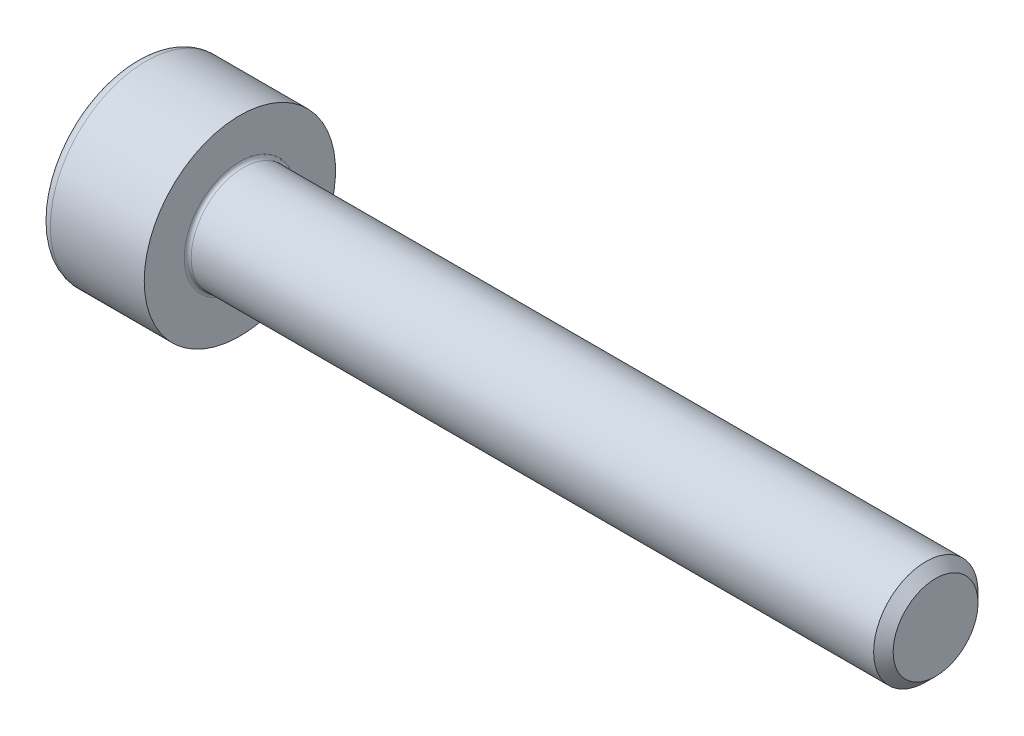
ISO-10303-21;
HEADER;
FILE_DESCRIPTION(('STEP AP214'),'2;1');
FILE_NAME('part.step','',(''),(''),'','','');
FILE_SCHEMA(('AUTOMOTIVE_DESIGN { 1 0 10303 214 1 1 1 1 }'));
ENDSEC;
DATA;
#1=APPLICATION_CONTEXT('core data for automotive mechanical design processes');
#2=APPLICATION_PROTOCOL_DEFINITION('international standard','automotive_design',2000,#1);
#3=PRODUCT_CONTEXT('',#1,'mechanical');
#4=PRODUCT('Part','Part','',(#3));
#5=PRODUCT_RELATED_PRODUCT_CATEGORY('part','',(#4));
#6=PRODUCT_DEFINITION_FORMATION('','',#4);
#7=PRODUCT_DEFINITION_CONTEXT('part definition',#1,'design');
#8=PRODUCT_DEFINITION('design','',#6,#7);
#9=PRODUCT_DEFINITION_SHAPE('','',#8);
#10=(LENGTH_UNIT() NAMED_UNIT(*) SI_UNIT(.MILLI.,.METRE.));
#11=(NAMED_UNIT(*) PLANE_ANGLE_UNIT() SI_UNIT($,.RADIAN.));
#12=(NAMED_UNIT(*) SI_UNIT($,.STERADIAN.) SOLID_ANGLE_UNIT());
#13=UNCERTAINTY_MEASURE_WITH_UNIT(LENGTH_MEASURE(1.E-05),#10,'distance_accuracy_value','');
#14=(GEOMETRIC_REPRESENTATION_CONTEXT(3) GLOBAL_UNCERTAINTY_ASSIGNED_CONTEXT((#13)) GLOBAL_UNIT_ASSIGNED_CONTEXT((#10,
#11,#12)) REPRESENTATION_CONTEXT('',''));
#15=CARTESIAN_POINT('',(0.,0.,0.));
#16=DIRECTION('',(0.,0.,1.));
#17=DIRECTION('',(1.,0.,0.));
#18=AXIS2_PLACEMENT_3D('',#15,#16,#17);
#19=CARTESIAN_POINT('',(0.,0.,0.));
#20=DIRECTION('',(-1.,0.,0.));
#21=DIRECTION('',(0.,0.,1.));
#22=AXIS2_PLACEMENT_3D('',#19,#20,#21);
#23=PLANE('',#22);
#24=DIRECTION('',(0.,-0.499999999999999,0.866025403784439));
#25=VECTOR('',#24,1.);
#26=CARTESIAN_POINT('',(0.,1.45492267835785,0.));
#27=LINE('',#26,#25);
#28=CARTESIAN_POINT('',(0.,1.45492267835785,0.));
#29=VERTEX_POINT('',#28);
#30=CARTESIAN_POINT('',(0.,0.727461339178922,1.26));
#31=VERTEX_POINT('',#30);
#32=EDGE_CURVE('E262',#29,#31,#27,.T.);
#33=ORIENTED_EDGE('',*,*,#32,.T.);
#34=DIRECTION('',(0.,1.,0.));
#35=VECTOR('',#34,1.);
#36=CARTESIAN_POINT('',(0.,-0.727461339178934,1.26));
#37=LINE('',#36,#35);
#38=CARTESIAN_POINT('',(0.,-0.727461339178934,1.26));
#39=VERTEX_POINT('',#38);
#40=EDGE_CURVE('E134',#39,#31,#37,.T.);
#41=ORIENTED_EDGE('',*,*,#40,.F.);
#42=DIRECTION('',(0.,-0.500000000000001,-0.866025403784438));
#43=VECTOR('',#42,1.);
#44=CARTESIAN_POINT('',(0.,-0.727461339178934,1.26));
#45=LINE('',#44,#43);
#46=CARTESIAN_POINT('',(0.,-1.45492267835786,0.));
#47=VERTEX_POINT('',#46);
#48=EDGE_CURVE('E265',#39,#47,#45,.T.);
#49=ORIENTED_EDGE('',*,*,#48,.T.);
#50=DIRECTION('',(0.,0.499999999999998,-0.86602540378444));
#51=VECTOR('',#50,1.);
#52=CARTESIAN_POINT('',(0.,-1.45492267835786,0.));
#53=LINE('',#52,#51);
#54=CARTESIAN_POINT('',(0.,-0.727461339178938,-1.26));
#55=VERTEX_POINT('',#54);
#56=EDGE_CURVE('E268',#47,#55,#53,.T.);
#57=ORIENTED_EDGE('',*,*,#56,.T.);
#58=DIRECTION('',(0.,-1.,0.));
#59=VECTOR('',#58,1.);
#60=CARTESIAN_POINT('',(0.,0.727461339178918,-1.26));
#61=LINE('',#60,#59);
#62=CARTESIAN_POINT('',(0.,0.727461339178918,-1.26));
#63=VERTEX_POINT('',#62);
#64=EDGE_CURVE('E271',#63,#55,#61,.T.);
#65=ORIENTED_EDGE('',*,*,#64,.F.);
#66=DIRECTION('',(0.,-0.500000000000001,-0.866025403784438));
#67=VECTOR('',#66,1.);
#68=CARTESIAN_POINT('',(0.,1.45492267835785,0.));
#69=LINE('',#68,#67);
#70=EDGE_CURVE('E129',#29,#63,#69,.T.);
#71=ORIENTED_EDGE('',*,*,#70,.F.);
#72=EDGE_LOOP('',(#33,#41,#49,#57,#65,#71));
#73=FACE_BOUND('',#72,.T.);
#74=CARTESIAN_POINT('',(0.,0.,0.));
#75=DIRECTION('',(-1.,0.,0.));
#76=DIRECTION('',(0.,0.,1.));
#77=AXIS2_PLACEMENT_3D('',#74,#75,#76);
#78=CIRCLE('',#77,2.45);
#79=CARTESIAN_POINT('',(0.,0.,2.45));
#80=VERTEX_POINT('',#79);
#81=EDGE_CURVE('E46',#80,#80,#78,.T.);
#82=ORIENTED_EDGE('',*,*,#81,.T.);
#83=EDGE_LOOP('',(#82));
#84=FACE_BOUND('',#83,.T.);
#85=ADVANCED_FACE('F38',(#73,#84),#23,.T.);
#86=CARTESIAN_POINT('',(-31.75,0.,0.));
#87=DIRECTION('',(-1.,0.,0.));
#88=DIRECTION('',(0.,0.,1.));
#89=AXIS2_PLACEMENT_3D('',#86,#87,#88);
#90=CYLINDRICAL_SURFACE('',#89,2.75);
#91=CARTESIAN_POINT('',(0.300000000000002,0.,0.));
#92=DIRECTION('',(-1.,0.,0.));
#93=DIRECTION('',(0.,0.,1.));
#94=AXIS2_PLACEMENT_3D('',#91,#92,#93);
#95=CIRCLE('',#94,2.75);
#96=CARTESIAN_POINT('',(0.300000000000002,0.,2.75));
#97=VERTEX_POINT('',#96);
#98=EDGE_CURVE('E11',#97,#97,#95,.F.);
#99=ORIENTED_EDGE('',*,*,#98,.T.);
#100=EDGE_LOOP('',(#99));
#101=FACE_BOUND('',#100,.T.);
#102=CARTESIAN_POINT('',(3.,0.,0.));
#103=DIRECTION('',(-1.,0.,0.));
#104=DIRECTION('',(0.,0.,1.));
#105=AXIS2_PLACEMENT_3D('',#102,#103,#104);
#106=CIRCLE('',#105,2.75);
#107=CARTESIAN_POINT('',(3.,0.,2.75));
#108=VERTEX_POINT('',#107);
#109=EDGE_CURVE('E152',#108,#108,#106,.T.);
#110=ORIENTED_EDGE('',*,*,#109,.T.);
#111=EDGE_LOOP('',(#110));
#112=FACE_BOUND('',#111,.T.);
#113=ADVANCED_FACE('F176',(#101,#112),#90,.T.);
#114=CARTESIAN_POINT('',(3.,2.75,0.));
#115=DIRECTION('',(1.,0.,0.));
#116=DIRECTION('',(0.,0.,-1.));
#117=AXIS2_PLACEMENT_3D('',#114,#115,#116);
#118=PLANE('',#117);
#119=CARTESIAN_POINT('',(3.,0.,0.));
#120=DIRECTION('',(1.,0.,0.));
#121=DIRECTION('',(0.,0.,-1.));
#122=AXIS2_PLACEMENT_3D('',#119,#120,#121);
#123=CIRCLE('',#122,1.59999999999995);
#124=CARTESIAN_POINT('',(3.,0.,-1.59999999999995));
#125=VERTEX_POINT('',#124);
#126=EDGE_CURVE('E155',#125,#125,#123,.F.);
#127=ORIENTED_EDGE('',*,*,#126,.T.);
#128=EDGE_LOOP('',(#127));
#129=FACE_BOUND('',#128,.T.);
#130=ORIENTED_EDGE('',*,*,#109,.F.);
#131=EDGE_LOOP('',(#130));
#132=FACE_BOUND('',#131,.T.);
#133=ADVANCED_FACE('F182',(#129,#132),#118,.T.);
#134=CARTESIAN_POINT('',(-31.75,0.,0.));
#135=DIRECTION('',(-1.,0.,0.));
#136=DIRECTION('',(0.,0.,1.));
#137=AXIS2_PLACEMENT_3D('',#134,#135,#136);
#138=CYLINDRICAL_SURFACE('',#137,1.49999999999995);
#139=CARTESIAN_POINT('',(3.1,0.,0.));
#140=DIRECTION('',(1.,0.,0.));
#141=DIRECTION('',(0.,0.,-1.));
#142=AXIS2_PLACEMENT_3D('',#139,#140,#141);
#143=CIRCLE('',#142,1.49999999999995);
#144=CARTESIAN_POINT('',(3.1,0.,-1.49999999999995));
#145=VERTEX_POINT('',#144);
#146=EDGE_CURVE('E158',#145,#145,#143,.T.);
#147=ORIENTED_EDGE('',*,*,#146,.T.);
#148=EDGE_LOOP('',(#147));
#149=FACE_BOUND('',#148,.T.);
#150=CARTESIAN_POINT('',(22.7194999999999,0.,0.));
#151=DIRECTION('',(-1.,0.,0.));
#152=DIRECTION('',(0.,0.,1.));
#153=AXIS2_PLACEMENT_3D('',#150,#151,#152);
#154=CIRCLE('',#153,1.49999999999991);
#155=CARTESIAN_POINT('',(22.7194999999999,0.,1.49999999999991));
#156=VERTEX_POINT('',#155);
#157=EDGE_CURVE('E149',#156,#156,#154,.T.);
#158=ORIENTED_EDGE('',*,*,#157,.T.);
#159=EDGE_LOOP('',(#158));
#160=FACE_BOUND('',#159,.T.);
#161=ADVANCED_FACE('F188',(#149,#160),#138,.T.);
#162=CARTESIAN_POINT('',(23.,0.,0.));
#163=DIRECTION('',(-1.,0.,0.));
#164=DIRECTION('',(0.,0.,1.));
#165=AXIS2_PLACEMENT_3D('',#162,#163,#164);
#166=CONICAL_SURFACE('',#165,1.2195,0.785398163397115);
#167=ORIENTED_EDGE('',*,*,#157,.F.);
#168=EDGE_LOOP('',(#167));
#169=FACE_BOUND('',#168,.T.);
#170=CARTESIAN_POINT('',(23.,0.,0.));
#171=DIRECTION('',(-1.,0.,0.));
#172=DIRECTION('',(0.,0.,1.));
#173=AXIS2_PLACEMENT_3D('',#170,#171,#172);
#174=CIRCLE('',#173,1.2195);
#175=CARTESIAN_POINT('',(23.,0.,1.2195));
#176=VERTEX_POINT('',#175);
#177=EDGE_CURVE('E145',#176,#176,#174,.T.);
#178=ORIENTED_EDGE('',*,*,#177,.T.);
#179=EDGE_LOOP('',(#178));
#180=FACE_BOUND('',#179,.T.);
#181=ADVANCED_FACE('F192',(#169,#180),#166,.T.);
#182=CARTESIAN_POINT('',(23.,1.2195,0.));
#183=DIRECTION('',(1.,0.,0.));
#184=DIRECTION('',(0.,0.,-1.));
#185=AXIS2_PLACEMENT_3D('',#182,#183,#184);
#186=PLANE('',#185);
#187=ORIENTED_EDGE('',*,*,#177,.F.);
#188=EDGE_LOOP('',(#187));
#189=FACE_BOUND('',#188,.T.);
#190=ADVANCED_FACE('F172',(#189),#186,.T.);
#191=CARTESIAN_POINT('',(3.1,0.,0.));
#192=DIRECTION('',(1.,0.,0.));
#193=DIRECTION('',(0.,0.,-1.));
#194=AXIS2_PLACEMENT_3D('',#191,#192,#193);
#195=TOROIDAL_SURFACE('',#194,1.59999999999995,0.1);
#196=ORIENTED_EDGE('',*,*,#146,.F.);
#197=EDGE_LOOP('',(#196));
#198=FACE_BOUND('',#197,.T.);
#199=ORIENTED_EDGE('',*,*,#126,.F.);
#200=EDGE_LOOP('',(#199));
#201=FACE_BOUND('',#200,.T.);
#202=ADVANCED_FACE('F165',(#198,#201),#195,.F.);
#203=CARTESIAN_POINT('',(0.300000000000002,0.,0.));
#204=DIRECTION('',(-1.,0.,0.));
#205=DIRECTION('',(0.,0.,1.));
#206=AXIS2_PLACEMENT_3D('',#203,#204,#205);
#207=TOROIDAL_SURFACE('',#206,2.45,0.3);
#208=ORIENTED_EDGE('',*,*,#98,.F.);
#209=EDGE_LOOP('',(#208));
#210=FACE_BOUND('',#209,.T.);
#211=ORIENTED_EDGE('',*,*,#81,.F.);
#212=EDGE_LOOP('',(#211));
#213=FACE_BOUND('',#212,.T.);
#214=ADVANCED_FACE('F40',(#210,#213),#207,.T.);
#215=CARTESIAN_POINT('',(1.3,1.45492267835785,0.));
#216=DIRECTION('',(0.,-0.866025403784439,-0.499999999999999));
#217=DIRECTION('',(0.,0.499999999999999,-0.866025403784439));
#218=AXIS2_PLACEMENT_3D('',#215,#216,#217);
#219=PLANE('',#218);
#220=ORIENTED_EDGE('',*,*,#32,.F.);
#221=DIRECTION('',(-1.,0.,0.));
#222=VECTOR('',#221,1.);
#223=CARTESIAN_POINT('',(1.3,1.45492267835785,0.));
#224=LINE('',#223,#222);
#225=CARTESIAN_POINT('',(1.3,1.45492267835785,0.));
#226=VERTEX_POINT('',#225);
#227=EDGE_CURVE('E252',#226,#29,#224,.T.);
#228=ORIENTED_EDGE('',*,*,#227,.F.);
#229=DIRECTION('',(0.,-0.499999999999999,0.866025403784439));
#230=VECTOR('',#229,1.);
#231=CARTESIAN_POINT('',(1.3,1.45492267835785,0.));
#232=LINE('',#231,#230);
#233=CARTESIAN_POINT('',(1.3,1.09119200876839,0.629999999999996));
#234=VERTEX_POINT('',#233);
#235=EDGE_CURVE('E121',#226,#234,#232,.T.);
#236=ORIENTED_EDGE('',*,*,#235,.T.);
#237=CARTESIAN_POINT('',(1.3,0.727461339178922,1.26));
#238=VERTEX_POINT('',#237);
#239=EDGE_CURVE('E112',#234,#238,#232,.T.);
#240=ORIENTED_EDGE('',*,*,#239,.T.);
#241=DIRECTION('',(-1.,0.,0.));
#242=VECTOR('',#241,1.);
#243=CARTESIAN_POINT('',(1.3,0.727461339178922,1.26));
#244=LINE('',#243,#242);
#245=EDGE_CURVE('E126',#238,#31,#244,.T.);
#246=ORIENTED_EDGE('',*,*,#245,.T.);
#247=EDGE_LOOP('',(#220,#228,#236,#240,#246));
#248=FACE_BOUND('',#247,.T.);
#249=ADVANCED_FACE('F125',(#248),#219,.T.);
#250=CARTESIAN_POINT('',(1.3,-0.727461339178934,1.26));
#251=DIRECTION('',(0.,0.,1.));
#252=DIRECTION('',(0.,-1.,0.));
#253=AXIS2_PLACEMENT_3D('',#250,#251,#252);
#254=PLANE('',#253);
#255=ORIENTED_EDGE('',*,*,#40,.T.);
#256=ORIENTED_EDGE('',*,*,#245,.F.);
#257=DIRECTION('',(0.,1.,0.));
#258=VECTOR('',#257,1.);
#259=CARTESIAN_POINT('',(1.3,-0.727461339178934,1.26));
#260=LINE('',#259,#258);
#261=CARTESIAN_POINT('',(1.3,0.,1.26));
#262=VERTEX_POINT('',#261);
#263=EDGE_CURVE('E109',#262,#238,#260,.T.);
#264=ORIENTED_EDGE('',*,*,#263,.F.);
#265=CARTESIAN_POINT('',(1.3,-0.727461339178934,1.26));
#266=VERTEX_POINT('',#265);
#267=EDGE_CURVE('E120',#266,#262,#260,.T.);
#268=ORIENTED_EDGE('',*,*,#267,.F.);
#269=DIRECTION('',(-1.,0.,0.));
#270=VECTOR('',#269,1.);
#271=CARTESIAN_POINT('',(1.3,-0.727461339178934,1.26));
#272=LINE('',#271,#270);
#273=EDGE_CURVE('E136',#266,#39,#272,.T.);
#274=ORIENTED_EDGE('',*,*,#273,.T.);
#275=EDGE_LOOP('',(#255,#256,#264,#268,#274));
#276=FACE_BOUND('',#275,.T.);
#277=ADVANCED_FACE('F131',(#276),#254,.F.);
#278=CARTESIAN_POINT('',(1.3,-0.727461339178934,1.26));
#279=DIRECTION('',(0.,0.866025403784438,-0.500000000000001));
#280=DIRECTION('',(0.,0.500000000000001,0.866025403784438));
#281=AXIS2_PLACEMENT_3D('',#278,#279,#280);
#282=PLANE('',#281);
#283=ORIENTED_EDGE('',*,*,#48,.F.);
#284=ORIENTED_EDGE('',*,*,#273,.F.);
#285=DIRECTION('',(0.,-0.500000000000001,-0.866025403784438));
#286=VECTOR('',#285,1.);
#287=CARTESIAN_POINT('',(1.3,-0.727461339178934,1.26));
#288=LINE('',#287,#286);
#289=CARTESIAN_POINT('',(1.3,-1.0911920087684,0.630000000000005));
#290=VERTEX_POINT('',#289);
#291=EDGE_CURVE('E291',#266,#290,#288,.T.);
#292=ORIENTED_EDGE('',*,*,#291,.T.);
#293=CARTESIAN_POINT('',(1.3,-1.45492267835786,0.));
#294=VERTEX_POINT('',#293);
#295=EDGE_CURVE('E280',#290,#294,#288,.T.);
#296=ORIENTED_EDGE('',*,*,#295,.T.);
#297=DIRECTION('',(-1.,0.,0.));
#298=VECTOR('',#297,1.);
#299=CARTESIAN_POINT('',(1.3,-1.45492267835786,0.));
#300=LINE('',#299,#298);
#301=EDGE_CURVE('E141',#294,#47,#300,.T.);
#302=ORIENTED_EDGE('',*,*,#301,.T.);
#303=EDGE_LOOP('',(#283,#284,#292,#296,#302));
#304=FACE_BOUND('',#303,.T.);
#305=ADVANCED_FACE('F206',(#304),#282,.T.);
#306=CARTESIAN_POINT('',(1.3,-1.45492267835786,0.));
#307=DIRECTION('',(0.,0.86602540378444,0.499999999999998));
#308=DIRECTION('',(0.,-0.499999999999998,0.86602540378444));
#309=AXIS2_PLACEMENT_3D('',#306,#307,#308);
#310=PLANE('',#309);
#311=ORIENTED_EDGE('',*,*,#56,.F.);
#312=ORIENTED_EDGE('',*,*,#301,.F.);
#313=DIRECTION('',(0.,0.499999999999998,-0.86602540378444));
#314=VECTOR('',#313,1.);
#315=CARTESIAN_POINT('',(1.3,-1.45492267835786,0.));
#316=LINE('',#315,#314);
#317=CARTESIAN_POINT('',(1.3,-1.0911920087684,-0.63));
#318=VERTEX_POINT('',#317);
#319=EDGE_CURVE('E258',#294,#318,#316,.T.);
#320=ORIENTED_EDGE('',*,*,#319,.T.);
#321=CARTESIAN_POINT('',(1.3,-0.727461339178938,-1.26));
#322=VERTEX_POINT('',#321);
#323=EDGE_CURVE('E290',#318,#322,#316,.T.);
#324=ORIENTED_EDGE('',*,*,#323,.T.);
#325=DIRECTION('',(-1.,0.,0.));
#326=VECTOR('',#325,1.);
#327=CARTESIAN_POINT('',(1.3,-0.727461339178938,-1.26));
#328=LINE('',#327,#326);
#329=EDGE_CURVE('E251',#322,#55,#328,.T.);
#330=ORIENTED_EDGE('',*,*,#329,.T.);
#331=EDGE_LOOP('',(#311,#312,#320,#324,#330));
#332=FACE_BOUND('',#331,.T.);
#333=ADVANCED_FACE('F209',(#332),#310,.T.);
#334=CARTESIAN_POINT('',(1.3,0.727461339178918,-1.26));
#335=DIRECTION('',(0.,0.,-1.));
#336=DIRECTION('',(0.,1.,0.));
#337=AXIS2_PLACEMENT_3D('',#334,#335,#336);
#338=PLANE('',#337);
#339=ORIENTED_EDGE('',*,*,#64,.T.);
#340=ORIENTED_EDGE('',*,*,#329,.F.);
#341=DIRECTION('',(0.,-1.,0.));
#342=VECTOR('',#341,1.);
#343=CARTESIAN_POINT('',(1.3,0.727461339178918,-1.26));
#344=LINE('',#343,#342);
#345=CARTESIAN_POINT('',(1.3,0.,-1.26));
#346=VERTEX_POINT('',#345);
#347=EDGE_CURVE('E255',#346,#322,#344,.T.);
#348=ORIENTED_EDGE('',*,*,#347,.F.);
#349=CARTESIAN_POINT('',(1.3,0.727461339178918,-1.26));
#350=VERTEX_POINT('',#349);
#351=EDGE_CURVE('E53',#350,#346,#344,.T.);
#352=ORIENTED_EDGE('',*,*,#351,.F.);
#353=DIRECTION('',(-1.,0.,0.));
#354=VECTOR('',#353,1.);
#355=CARTESIAN_POINT('',(1.3,0.727461339178918,-1.26));
#356=LINE('',#355,#354);
#357=EDGE_CURVE('E248',#350,#63,#356,.T.);
#358=ORIENTED_EDGE('',*,*,#357,.T.);
#359=EDGE_LOOP('',(#339,#340,#348,#352,#358));
#360=FACE_BOUND('',#359,.T.);
#361=ADVANCED_FACE('F213',(#360),#338,.F.);
#362=CARTESIAN_POINT('',(1.3,1.45492267835785,0.));
#363=DIRECTION('',(0.,0.866025403784438,-0.500000000000001));
#364=DIRECTION('',(0.,0.500000000000001,0.866025403784438));
#365=AXIS2_PLACEMENT_3D('',#362,#363,#364);
#366=PLANE('',#365);
#367=ORIENTED_EDGE('',*,*,#70,.T.);
#368=ORIENTED_EDGE('',*,*,#357,.F.);
#369=DIRECTION('',(0.,-0.500000000000001,-0.866025403784438));
#370=VECTOR('',#369,1.);
#371=CARTESIAN_POINT('',(1.3,1.45492267835785,0.));
#372=LINE('',#371,#370);
#373=CARTESIAN_POINT('',(1.3,1.09119200876838,-0.629999999999997));
#374=VERTEX_POINT('',#373);
#375=EDGE_CURVE('E238',#374,#350,#372,.T.);
#376=ORIENTED_EDGE('',*,*,#375,.F.);
#377=EDGE_CURVE('E244',#226,#374,#372,.T.);
#378=ORIENTED_EDGE('',*,*,#377,.F.);
#379=ORIENTED_EDGE('',*,*,#227,.T.);
#380=EDGE_LOOP('',(#367,#368,#376,#378,#379));
#381=FACE_BOUND('',#380,.T.);
#382=ADVANCED_FACE('F217',(#381),#366,.F.);
#383=CARTESIAN_POINT('',(1.3,2.18238401753677,-1.26));
#384=DIRECTION('',(1.,0.,0.));
#385=DIRECTION('',(0.,0.,-1.));
#386=AXIS2_PLACEMENT_3D('',#383,#384,#385);
#387=PLANE('',#386);
#388=ORIENTED_EDGE('',*,*,#347,.T.);
#389=ORIENTED_EDGE('',*,*,#323,.F.);
#390=CARTESIAN_POINT('',(1.3,0.,0.));
#391=DIRECTION('',(-1.,0.,0.));
#392=DIRECTION('',(0.,0.,1.));
#393=AXIS2_PLACEMENT_3D('',#390,#391,#392);
#394=CIRCLE('',#393,1.26);
#395=EDGE_CURVE('E286',#346,#318,#394,.T.);
#396=ORIENTED_EDGE('',*,*,#395,.F.);
#397=EDGE_LOOP('',(#388,#389,#396));
#398=FACE_BOUND('',#397,.T.);
#399=ADVANCED_FACE('F221',(#398),#387,.F.);
#400=ORIENTED_EDGE('',*,*,#319,.F.);
#401=ORIENTED_EDGE('',*,*,#295,.F.);
#402=EDGE_CURVE('E139',#318,#290,#394,.T.);
#403=ORIENTED_EDGE('',*,*,#402,.F.);
#404=EDGE_LOOP('',(#400,#401,#403));
#405=FACE_BOUND('',#404,.T.);
#406=ADVANCED_FACE('F224',(#405),#387,.F.);
#407=ORIENTED_EDGE('',*,*,#291,.F.);
#408=ORIENTED_EDGE('',*,*,#267,.T.);
#409=EDGE_CURVE('E135',#290,#262,#394,.T.);
#410=ORIENTED_EDGE('',*,*,#409,.F.);
#411=EDGE_LOOP('',(#407,#408,#410));
#412=FACE_BOUND('',#411,.T.);
#413=ADVANCED_FACE('F229',(#412),#387,.F.);
#414=ORIENTED_EDGE('',*,*,#263,.T.);
#415=ORIENTED_EDGE('',*,*,#239,.F.);
#416=EDGE_CURVE('E115',#262,#234,#394,.T.);
#417=ORIENTED_EDGE('',*,*,#416,.F.);
#418=EDGE_LOOP('',(#414,#415,#417));
#419=FACE_BOUND('',#418,.T.);
#420=ADVANCED_FACE('F111',(#419),#387,.F.);
#421=ORIENTED_EDGE('',*,*,#235,.F.);
#422=ORIENTED_EDGE('',*,*,#377,.T.);
#423=EDGE_CURVE('E146',#234,#374,#394,.T.);
#424=ORIENTED_EDGE('',*,*,#423,.F.);
#425=EDGE_LOOP('',(#421,#422,#424));
#426=FACE_BOUND('',#425,.T.);
#427=ADVANCED_FACE('F232',(#426),#387,.F.);
#428=ORIENTED_EDGE('',*,*,#375,.T.);
#429=ORIENTED_EDGE('',*,*,#351,.T.);
#430=EDGE_CURVE('E241',#374,#346,#394,.T.);
#431=ORIENTED_EDGE('',*,*,#430,.F.);
#432=EDGE_LOOP('',(#428,#429,#431));
#433=FACE_BOUND('',#432,.T.);
#434=ADVANCED_FACE('F202',(#433),#387,.F.);
#435=CARTESIAN_POINT('',(1.3,0.,0.));
#436=DIRECTION('',(-1.,0.,0.));
#437=DIRECTION('',(0.,0.,1.));
#438=AXIS2_PLACEMENT_3D('',#435,#436,#437);
#439=CONICAL_SURFACE('',#438,1.26,1.04719755119659);
#440=CARTESIAN_POINT('',(2.02746133917894,0.,0.));
#441=VERTEX_POINT('',#440);
#442=VERTEX_LOOP('',#441);
#443=FACE_BOUND('',#442,.T.);
#444=ORIENTED_EDGE('',*,*,#416,.T.);
#445=ORIENTED_EDGE('',*,*,#423,.T.);
#446=ORIENTED_EDGE('',*,*,#430,.T.);
#447=ORIENTED_EDGE('',*,*,#395,.T.);
#448=ORIENTED_EDGE('',*,*,#402,.T.);
#449=ORIENTED_EDGE('',*,*,#409,.T.);
#450=EDGE_LOOP('',(#444,#445,#446,#447,#448,#449));
#451=FACE_BOUND('',#450,.T.);
#452=ADVANCED_FACE('F200',(#443,#451),#439,.F.);
#453=CLOSED_SHELL('',(#85,#113,#133,#161,#181,#190,#202,#214,#249,#277,#305,#333,#361,#382,#399,
#406,#413,#420,#427,#434,#452));
#454=MANIFOLD_SOLID_BREP('B2',#453);
#455=ADVANCED_BREP_SHAPE_REPRESENTATION('',(#18,#454),#14);
#456=SHAPE_DEFINITION_REPRESENTATION(#9,#455);
ENDSEC;
END-ISO-10303-21;
